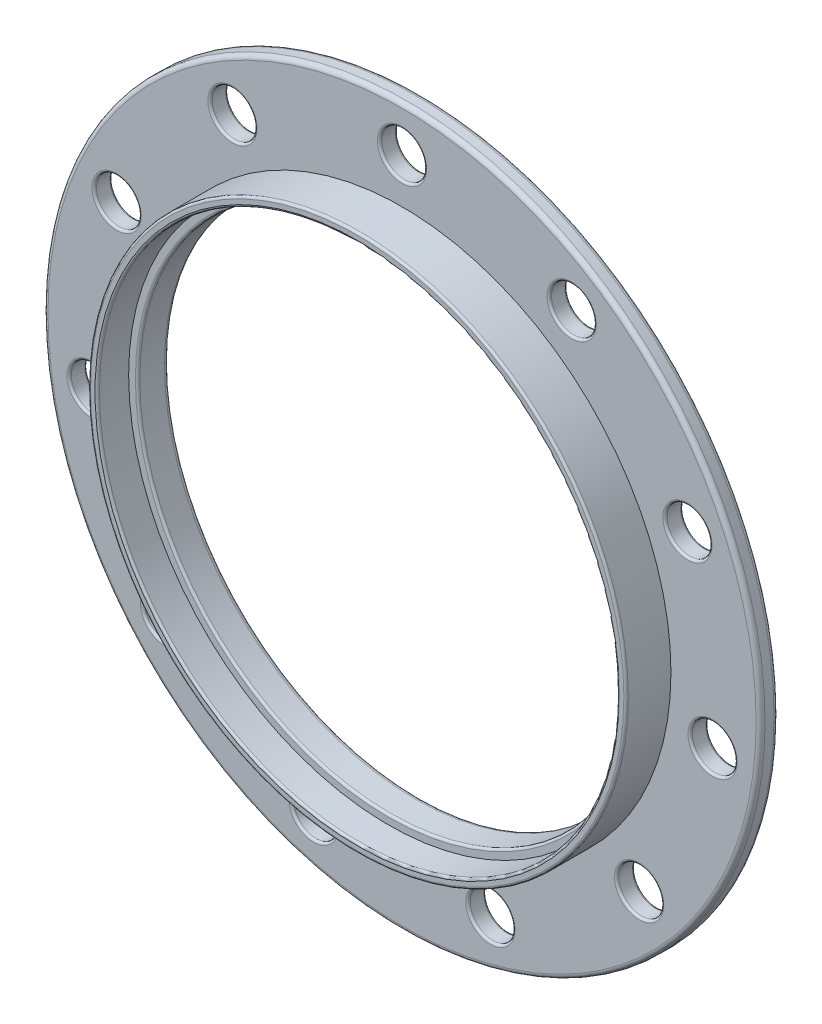
ISO-10303-21;
HEADER;
FILE_DESCRIPTION(('STEP AP214'),'2;1');
FILE_NAME('part.step','',(''),(''),'','','');
FILE_SCHEMA(('AUTOMOTIVE_DESIGN { 1 0 10303 214 1 1 1 1 }'));
ENDSEC;
DATA;
#1=APPLICATION_CONTEXT('core data for automotive mechanical design processes');
#2=APPLICATION_PROTOCOL_DEFINITION('international standard','automotive_design',2000,#1);
#3=PRODUCT_CONTEXT('',#1,'mechanical');
#4=PRODUCT('Part','Part','',(#3));
#5=PRODUCT_RELATED_PRODUCT_CATEGORY('part','',(#4));
#6=PRODUCT_DEFINITION_FORMATION('','',#4);
#7=PRODUCT_DEFINITION_CONTEXT('part definition',#1,'design');
#8=PRODUCT_DEFINITION('design','',#6,#7);
#9=PRODUCT_DEFINITION_SHAPE('','',#8);
#10=(LENGTH_UNIT() NAMED_UNIT(*) SI_UNIT(.MILLI.,.METRE.));
#11=(NAMED_UNIT(*) PLANE_ANGLE_UNIT() SI_UNIT($,.RADIAN.));
#12=(NAMED_UNIT(*) SI_UNIT($,.STERADIAN.) SOLID_ANGLE_UNIT());
#13=UNCERTAINTY_MEASURE_WITH_UNIT(LENGTH_MEASURE(1.E-05),#10,'distance_accuracy_value','');
#14=(GEOMETRIC_REPRESENTATION_CONTEXT(3) GLOBAL_UNCERTAINTY_ASSIGNED_CONTEXT((#13)) GLOBAL_UNIT_ASSIGNED_CONTEXT((#10,
#11,#12)) REPRESENTATION_CONTEXT('',''));
#15=CARTESIAN_POINT('',(0.,0.,0.));
#16=DIRECTION('',(0.,0.,1.));
#17=DIRECTION('',(1.,0.,0.));
#18=AXIS2_PLACEMENT_3D('',#15,#16,#17);
#19=CARTESIAN_POINT('',(0.,0.,7.));
#20=DIRECTION('',(0.,0.,-1.));
#21=DIRECTION('',(-1.,0.,0.));
#22=AXIS2_PLACEMENT_3D('',#19,#20,#21);
#23=CYLINDRICAL_SURFACE('',#22,29.);
#24=CARTESIAN_POINT('',(0.,0.,6.75));
#25=DIRECTION('',(0.,0.,1.));
#26=DIRECTION('',(1.,0.,0.));
#27=AXIS2_PLACEMENT_3D('',#24,#25,#26);
#28=CIRCLE('',#27,29.);
#29=CARTESIAN_POINT('',(29.,0.,6.75));
#30=VERTEX_POINT('',#29);
#31=EDGE_CURVE('E199',#30,#30,#28,.T.);
#32=ORIENTED_EDGE('',*,*,#31,.T.);
#33=EDGE_LOOP('',(#32));
#34=FACE_BOUND('',#33,.T.);
#35=CARTESIAN_POINT('',(0.,0.,3.5));
#36=DIRECTION('',(0.,0.,-1.));
#37=DIRECTION('',(-1.,0.,0.));
#38=AXIS2_PLACEMENT_3D('',#35,#36,#37);
#39=CIRCLE('',#38,29.);
#40=CARTESIAN_POINT('',(-29.,0.,3.5));
#41=VERTEX_POINT('',#40);
#42=EDGE_CURVE('E211',#41,#41,#39,.T.);
#43=ORIENTED_EDGE('',*,*,#42,.T.);
#44=EDGE_LOOP('',(#43));
#45=FACE_BOUND('',#44,.T.);
#46=ADVANCED_FACE('F32',(#34,#45),#23,.F.);
#47=CARTESIAN_POINT('',(0.,0.,2.));
#48=DIRECTION('',(0.,0.,-1.));
#49=DIRECTION('',(-1.,0.,0.));
#50=AXIS2_PLACEMENT_3D('',#47,#48,#49);
#51=CYLINDRICAL_SURFACE('',#50,40.);
#52=CARTESIAN_POINT('',(0.,0.,1.5));
#53=DIRECTION('',(0.,0.,1.));
#54=DIRECTION('',(1.,0.,0.));
#55=AXIS2_PLACEMENT_3D('',#52,#53,#54);
#56=CIRCLE('',#55,40.);
#57=CARTESIAN_POINT('',(40.,0.,1.5));
#58=VERTEX_POINT('',#57);
#59=EDGE_CURVE('E181',#58,#58,#56,.F.);
#60=ORIENTED_EDGE('',*,*,#59,.T.);
#61=EDGE_LOOP('',(#60));
#62=FACE_BOUND('',#61,.T.);
#63=CARTESIAN_POINT('',(0.,0.,0.5));
#64=DIRECTION('',(0.,0.,1.));
#65=DIRECTION('',(1.,0.,0.));
#66=AXIS2_PLACEMENT_3D('',#63,#64,#65);
#67=CIRCLE('',#66,40.);
#68=CARTESIAN_POINT('',(40.,0.,0.5));
#69=VERTEX_POINT('',#68);
#70=EDGE_CURVE('E184',#69,#69,#67,.T.);
#71=ORIENTED_EDGE('',*,*,#70,.T.);
#72=EDGE_LOOP('',(#71));
#73=FACE_BOUND('',#72,.T.);
#74=ADVANCED_FACE('F233',(#62,#73),#51,.T.);
#75=CARTESIAN_POINT('',(0.,0.,2.));
#76=DIRECTION('',(0.,0.,1.));
#77=DIRECTION('',(1.,0.,0.));
#78=AXIS2_PLACEMENT_3D('',#75,#76,#77);
#79=PLANE('',#78);
#80=CARTESIAN_POINT('',(26.451235102399,-22.920125688085,2.));
#81=DIRECTION('',(0.,0.,1.));
#82=DIRECTION('',(1.,0.,0.));
#83=AXIS2_PLACEMENT_3D('',#80,#81,#82);
#84=CIRCLE('',#83,2.75);
#85=CARTESIAN_POINT('',(29.201235102399,-22.920125688085,2.));
#86=VERTEX_POINT('',#85);
#87=EDGE_CURVE('E100',#86,#86,#84,.F.);
#88=ORIENTED_EDGE('',*,*,#87,.T.);
#89=EDGE_LOOP('',(#88));
#90=FACE_BOUND('',#89,.T.);
#91=CARTESIAN_POINT('',(34.6437504658327,-4.98101933956498,2.));
#92=DIRECTION('',(0.,0.,1.));
#93=DIRECTION('',(1.,0.,0.));
#94=AXIS2_PLACEMENT_3D('',#91,#92,#93);
#95=CIRCLE('',#94,2.75);
#96=CARTESIAN_POINT('',(37.3937504658327,-4.98101933956498,2.));
#97=VERTEX_POINT('',#96);
#98=EDGE_CURVE('E103',#97,#97,#95,.F.);
#99=ORIENTED_EDGE('',*,*,#98,.T.);
#100=EDGE_LOOP('',(#99));
#101=FACE_BOUND('',#100,.T.);
#102=CARTESIAN_POINT('',(31.8371198374081,14.539525455066,2.));
#103=DIRECTION('',(0.,0.,1.));
#104=DIRECTION('',(1.,0.,0.));
#105=AXIS2_PLACEMENT_3D('',#102,#103,#104);
#106=CIRCLE('',#105,2.75);
#107=CARTESIAN_POINT('',(34.5871198374081,14.539525455066,2.));
#108=VERTEX_POINT('',#107);
#109=EDGE_CURVE('E106',#108,#108,#106,.F.);
#110=ORIENTED_EDGE('',*,*,#109,.T.);
#111=EDGE_LOOP('',(#110));
#112=FACE_BOUND('',#111,.T.);
#113=CARTESIAN_POINT('',(18.9224286109459,29.4438736490913,2.));
#114=DIRECTION('',(0.,0.,1.));
#115=DIRECTION('',(1.,0.,0.));
#116=AXIS2_PLACEMENT_3D('',#113,#114,#115);
#117=CIRCLE('',#116,2.75);
#118=CARTESIAN_POINT('',(21.6724286109459,29.4438736490913,2.));
#119=VERTEX_POINT('',#118);
#120=EDGE_CURVE('E109',#119,#119,#117,.F.);
#121=ORIENTED_EDGE('',*,*,#120,.T.);
#122=EDGE_LOOP('',(#121));
#123=FACE_BOUND('',#122,.T.);
#124=CARTESIAN_POINT('',(0.,35.,2.));
#125=DIRECTION('',(0.,0.,1.));
#126=DIRECTION('',(1.,0.,0.));
#127=AXIS2_PLACEMENT_3D('',#124,#125,#126);
#128=CIRCLE('',#127,2.75);
#129=CARTESIAN_POINT('',(2.75,35.,2.));
#130=VERTEX_POINT('',#129);
#131=EDGE_CURVE('E112',#130,#130,#128,.F.);
#132=ORIENTED_EDGE('',*,*,#131,.T.);
#133=EDGE_LOOP('',(#132));
#134=FACE_BOUND('',#133,.T.);
#135=CARTESIAN_POINT('',(-18.9224286109459,29.4438736490913,2.));
#136=DIRECTION('',(0.,0.,1.));
#137=DIRECTION('',(1.,0.,0.));
#138=AXIS2_PLACEMENT_3D('',#135,#136,#137);
#139=CIRCLE('',#138,2.75);
#140=CARTESIAN_POINT('',(-16.1724286109459,29.4438736490913,2.));
#141=VERTEX_POINT('',#140);
#142=EDGE_CURVE('E115',#141,#141,#139,.F.);
#143=ORIENTED_EDGE('',*,*,#142,.T.);
#144=EDGE_LOOP('',(#143));
#145=FACE_BOUND('',#144,.T.);
#146=CARTESIAN_POINT('',(-31.8371198374082,14.539525455066,2.));
#147=DIRECTION('',(0.,0.,1.));
#148=DIRECTION('',(1.,0.,0.));
#149=AXIS2_PLACEMENT_3D('',#146,#147,#148);
#150=CIRCLE('',#149,2.75);
#151=CARTESIAN_POINT('',(-29.0871198374082,14.539525455066,2.));
#152=VERTEX_POINT('',#151);
#153=EDGE_CURVE('E118',#152,#152,#150,.F.);
#154=ORIENTED_EDGE('',*,*,#153,.T.);
#155=EDGE_LOOP('',(#154));
#156=FACE_BOUND('',#155,.T.);
#157=CARTESIAN_POINT('',(-34.6437504658326,-4.98101933956498,2.));
#158=DIRECTION('',(0.,0.,1.));
#159=DIRECTION('',(1.,0.,0.));
#160=AXIS2_PLACEMENT_3D('',#157,#158,#159);
#161=CIRCLE('',#160,2.75);
#162=CARTESIAN_POINT('',(-31.8937504658326,-4.98101933956498,2.));
#163=VERTEX_POINT('',#162);
#164=EDGE_CURVE('E121',#163,#163,#161,.F.);
#165=ORIENTED_EDGE('',*,*,#164,.T.);
#166=EDGE_LOOP('',(#165));
#167=FACE_BOUND('',#166,.T.);
#168=CARTESIAN_POINT('',(-26.451235102399,-22.920125688085,2.));
#169=DIRECTION('',(0.,0.,1.));
#170=DIRECTION('',(1.,0.,0.));
#171=AXIS2_PLACEMENT_3D('',#168,#169,#170);
#172=CIRCLE('',#171,2.75);
#173=CARTESIAN_POINT('',(-23.701235102399,-22.920125688085,2.));
#174=VERTEX_POINT('',#173);
#175=EDGE_CURVE('E124',#174,#174,#172,.F.);
#176=ORIENTED_EDGE('',*,*,#175,.T.);
#177=EDGE_LOOP('',(#176));
#178=FACE_BOUND('',#177,.T.);
#179=CARTESIAN_POINT('',(-9.86063948945005,-33.5822540765074,2.));
#180=DIRECTION('',(0.,0.,1.));
#181=DIRECTION('',(1.,0.,0.));
#182=AXIS2_PLACEMENT_3D('',#179,#180,#181);
#183=CIRCLE('',#182,2.75);
#184=CARTESIAN_POINT('',(-7.11063948945005,-33.5822540765074,2.));
#185=VERTEX_POINT('',#184);
#186=EDGE_CURVE('E127',#185,#185,#183,.F.);
#187=ORIENTED_EDGE('',*,*,#186,.T.);
#188=EDGE_LOOP('',(#187));
#189=FACE_BOUND('',#188,.T.);
#190=CARTESIAN_POINT('',(9.86063948945004,-33.5822540765074,2.));
#191=DIRECTION('',(0.,0.,1.));
#192=DIRECTION('',(1.,0.,0.));
#193=AXIS2_PLACEMENT_3D('',#190,#191,#192);
#194=CIRCLE('',#193,2.75);
#195=CARTESIAN_POINT('',(12.61063948945,-33.5822540765074,2.));
#196=VERTEX_POINT('',#195);
#197=EDGE_CURVE('E130',#196,#196,#194,.F.);
#198=ORIENTED_EDGE('',*,*,#197,.T.);
#199=EDGE_LOOP('',(#198));
#200=FACE_BOUND('',#199,.T.);
#201=CARTESIAN_POINT('',(0.,0.,2.));
#202=DIRECTION('',(0.,0.,1.));
#203=DIRECTION('',(1.,0.,0.));
#204=AXIS2_PLACEMENT_3D('',#201,#202,#203);
#205=CIRCLE('',#204,39.5);
#206=CARTESIAN_POINT('',(39.5,0.,2.));
#207=VERTEX_POINT('',#206);
#208=EDGE_CURVE('E187',#207,#207,#205,.T.);
#209=ORIENTED_EDGE('',*,*,#208,.T.);
#210=EDGE_LOOP('',(#209));
#211=FACE_BOUND('',#210,.T.);
#212=CARTESIAN_POINT('',(0.,0.,2.));
#213=DIRECTION('',(0.,0.,1.));
#214=DIRECTION('',(1.,0.,0.));
#215=AXIS2_PLACEMENT_3D('',#212,#213,#214);
#216=CIRCLE('',#215,30.);
#217=CARTESIAN_POINT('',(30.,0.,2.));
#218=VERTEX_POINT('',#217);
#219=EDGE_CURVE('E208',#218,#218,#216,.T.);
#220=ORIENTED_EDGE('',*,*,#219,.F.);
#221=EDGE_LOOP('',(#220));
#222=FACE_BOUND('',#221,.T.);
#223=ADVANCED_FACE('F239',(#90,#101,#112,#123,#134,#145,#156,#167,#178,#189,#200,#211,#222),#79,.T.);
#224=CARTESIAN_POINT('',(0.,0.,0.));
#225=DIRECTION('',(0.,0.,1.));
#226=DIRECTION('',(1.,0.,0.));
#227=AXIS2_PLACEMENT_3D('',#224,#225,#226);
#228=PLANE('',#227);
#229=CARTESIAN_POINT('',(26.451235102399,-22.920125688085,0.));
#230=DIRECTION('',(0.,0.,1.));
#231=DIRECTION('',(1.,0.,0.));
#232=AXIS2_PLACEMENT_3D('',#229,#230,#231);
#233=CIRCLE('',#232,2.75);
#234=CARTESIAN_POINT('',(29.201235102399,-22.920125688085,0.));
#235=VERTEX_POINT('',#234);
#236=EDGE_CURVE('E139',#235,#235,#233,.T.);
#237=ORIENTED_EDGE('',*,*,#236,.T.);
#238=EDGE_LOOP('',(#237));
#239=FACE_BOUND('',#238,.T.);
#240=CARTESIAN_POINT('',(34.6437504658327,-4.98101933956498,0.));
#241=DIRECTION('',(0.,0.,1.));
#242=DIRECTION('',(1.,0.,0.));
#243=AXIS2_PLACEMENT_3D('',#240,#241,#242);
#244=CIRCLE('',#243,2.75);
#245=CARTESIAN_POINT('',(37.3937504658327,-4.98101933956498,0.));
#246=VERTEX_POINT('',#245);
#247=EDGE_CURVE('E142',#246,#246,#244,.T.);
#248=ORIENTED_EDGE('',*,*,#247,.T.);
#249=EDGE_LOOP('',(#248));
#250=FACE_BOUND('',#249,.T.);
#251=CARTESIAN_POINT('',(31.8371198374081,14.539525455066,0.));
#252=DIRECTION('',(0.,0.,1.));
#253=DIRECTION('',(1.,0.,0.));
#254=AXIS2_PLACEMENT_3D('',#251,#252,#253);
#255=CIRCLE('',#254,2.75);
#256=CARTESIAN_POINT('',(34.5871198374081,14.539525455066,0.));
#257=VERTEX_POINT('',#256);
#258=EDGE_CURVE('E145',#257,#257,#255,.T.);
#259=ORIENTED_EDGE('',*,*,#258,.T.);
#260=EDGE_LOOP('',(#259));
#261=FACE_BOUND('',#260,.T.);
#262=CARTESIAN_POINT('',(18.9224286109459,29.4438736490913,0.));
#263=DIRECTION('',(0.,0.,1.));
#264=DIRECTION('',(1.,0.,0.));
#265=AXIS2_PLACEMENT_3D('',#262,#263,#264);
#266=CIRCLE('',#265,2.75);
#267=CARTESIAN_POINT('',(21.6724286109459,29.4438736490913,0.));
#268=VERTEX_POINT('',#267);
#269=EDGE_CURVE('E148',#268,#268,#266,.T.);
#270=ORIENTED_EDGE('',*,*,#269,.T.);
#271=EDGE_LOOP('',(#270));
#272=FACE_BOUND('',#271,.T.);
#273=CARTESIAN_POINT('',(0.,35.,0.));
#274=DIRECTION('',(0.,0.,1.));
#275=DIRECTION('',(1.,0.,0.));
#276=AXIS2_PLACEMENT_3D('',#273,#274,#275);
#277=CIRCLE('',#276,2.75);
#278=CARTESIAN_POINT('',(2.75,35.,0.));
#279=VERTEX_POINT('',#278);
#280=EDGE_CURVE('E151',#279,#279,#277,.T.);
#281=ORIENTED_EDGE('',*,*,#280,.T.);
#282=EDGE_LOOP('',(#281));
#283=FACE_BOUND('',#282,.T.);
#284=CARTESIAN_POINT('',(-18.9224286109459,29.4438736490913,0.));
#285=DIRECTION('',(0.,0.,1.));
#286=DIRECTION('',(1.,0.,0.));
#287=AXIS2_PLACEMENT_3D('',#284,#285,#286);
#288=CIRCLE('',#287,2.75);
#289=CARTESIAN_POINT('',(-16.1724286109459,29.4438736490913,0.));
#290=VERTEX_POINT('',#289);
#291=EDGE_CURVE('E154',#290,#290,#288,.T.);
#292=ORIENTED_EDGE('',*,*,#291,.T.);
#293=EDGE_LOOP('',(#292));
#294=FACE_BOUND('',#293,.T.);
#295=CARTESIAN_POINT('',(-31.8371198374082,14.539525455066,0.));
#296=DIRECTION('',(0.,0.,1.));
#297=DIRECTION('',(1.,0.,0.));
#298=AXIS2_PLACEMENT_3D('',#295,#296,#297);
#299=CIRCLE('',#298,2.75);
#300=CARTESIAN_POINT('',(-29.0871198374082,14.539525455066,0.));
#301=VERTEX_POINT('',#300);
#302=EDGE_CURVE('E157',#301,#301,#299,.T.);
#303=ORIENTED_EDGE('',*,*,#302,.T.);
#304=EDGE_LOOP('',(#303));
#305=FACE_BOUND('',#304,.T.);
#306=CARTESIAN_POINT('',(-34.6437504658326,-4.98101933956498,0.));
#307=DIRECTION('',(0.,0.,1.));
#308=DIRECTION('',(1.,0.,0.));
#309=AXIS2_PLACEMENT_3D('',#306,#307,#308);
#310=CIRCLE('',#309,2.75);
#311=CARTESIAN_POINT('',(-31.8937504658326,-4.98101933956498,0.));
#312=VERTEX_POINT('',#311);
#313=EDGE_CURVE('E160',#312,#312,#310,.T.);
#314=ORIENTED_EDGE('',*,*,#313,.T.);
#315=EDGE_LOOP('',(#314));
#316=FACE_BOUND('',#315,.T.);
#317=CARTESIAN_POINT('',(-26.451235102399,-22.920125688085,0.));
#318=DIRECTION('',(0.,0.,1.));
#319=DIRECTION('',(1.,0.,0.));
#320=AXIS2_PLACEMENT_3D('',#317,#318,#319);
#321=CIRCLE('',#320,2.75);
#322=CARTESIAN_POINT('',(-23.701235102399,-22.920125688085,0.));
#323=VERTEX_POINT('',#322);
#324=EDGE_CURVE('E163',#323,#323,#321,.T.);
#325=ORIENTED_EDGE('',*,*,#324,.T.);
#326=EDGE_LOOP('',(#325));
#327=FACE_BOUND('',#326,.T.);
#328=CARTESIAN_POINT('',(-9.86063948945005,-33.5822540765074,0.));
#329=DIRECTION('',(0.,0.,1.));
#330=DIRECTION('',(1.,0.,0.));
#331=AXIS2_PLACEMENT_3D('',#328,#329,#330);
#332=CIRCLE('',#331,2.75);
#333=CARTESIAN_POINT('',(-7.11063948945005,-33.5822540765074,0.));
#334=VERTEX_POINT('',#333);
#335=EDGE_CURVE('E166',#334,#334,#332,.T.);
#336=ORIENTED_EDGE('',*,*,#335,.T.);
#337=EDGE_LOOP('',(#336));
#338=FACE_BOUND('',#337,.T.);
#339=CARTESIAN_POINT('',(9.86063948945004,-33.5822540765074,0.));
#340=DIRECTION('',(0.,0.,1.));
#341=DIRECTION('',(1.,0.,0.));
#342=AXIS2_PLACEMENT_3D('',#339,#340,#341);
#343=CIRCLE('',#342,2.75);
#344=CARTESIAN_POINT('',(12.61063948945,-33.5822540765074,0.));
#345=VERTEX_POINT('',#344);
#346=EDGE_CURVE('E169',#345,#345,#343,.T.);
#347=ORIENTED_EDGE('',*,*,#346,.T.);
#348=EDGE_LOOP('',(#347));
#349=FACE_BOUND('',#348,.T.);
#350=CARTESIAN_POINT('',(0.,0.,0.));
#351=DIRECTION('',(0.,0.,1.));
#352=DIRECTION('',(1.,0.,0.));
#353=AXIS2_PLACEMENT_3D('',#350,#351,#352);
#354=CIRCLE('',#353,28.5);
#355=CARTESIAN_POINT('',(28.5,0.,0.));
#356=VERTEX_POINT('',#355);
#357=EDGE_CURVE('E172',#356,#356,#354,.T.);
#358=ORIENTED_EDGE('',*,*,#357,.T.);
#359=EDGE_LOOP('',(#358));
#360=FACE_BOUND('',#359,.T.);
#361=CARTESIAN_POINT('',(0.,0.,0.));
#362=DIRECTION('',(0.,0.,1.));
#363=DIRECTION('',(1.,0.,0.));
#364=AXIS2_PLACEMENT_3D('',#361,#362,#363);
#365=CIRCLE('',#364,39.5);
#366=CARTESIAN_POINT('',(39.5,0.,0.));
#367=VERTEX_POINT('',#366);
#368=EDGE_CURVE('E175',#367,#367,#365,.F.);
#369=ORIENTED_EDGE('',*,*,#368,.T.);
#370=EDGE_LOOP('',(#369));
#371=FACE_BOUND('',#370,.T.);
#372=ADVANCED_FACE('F250',(#239,#250,#261,#272,#283,#294,#305,#316,#327,#338,#349,#360,#371),
#228,.F.);
#373=CARTESIAN_POINT('',(0.,0.,7.));
#374=DIRECTION('',(0.,0.,1.));
#375=DIRECTION('',(1.,0.,0.));
#376=AXIS2_PLACEMENT_3D('',#373,#374,#375);
#377=PLANE('',#376);
#378=CARTESIAN_POINT('',(0.,0.,7.));
#379=DIRECTION('',(0.,0.,1.));
#380=DIRECTION('',(1.,0.,0.));
#381=AXIS2_PLACEMENT_3D('',#378,#379,#380);
#382=CIRCLE('',#381,29.25);
#383=CARTESIAN_POINT('',(29.25,0.,7.));
#384=VERTEX_POINT('',#383);
#385=EDGE_CURVE('E193',#384,#384,#382,.F.);
#386=ORIENTED_EDGE('',*,*,#385,.T.);
#387=EDGE_LOOP('',(#386));
#388=FACE_BOUND('',#387,.T.);
#389=CARTESIAN_POINT('',(0.,0.,7.));
#390=DIRECTION('',(0.,0.,1.));
#391=DIRECTION('',(1.,0.,0.));
#392=AXIS2_PLACEMENT_3D('',#389,#390,#391);
#393=CIRCLE('',#392,29.75);
#394=CARTESIAN_POINT('',(29.75,0.,7.));
#395=VERTEX_POINT('',#394);
#396=EDGE_CURVE('E196',#395,#395,#393,.T.);
#397=ORIENTED_EDGE('',*,*,#396,.T.);
#398=EDGE_LOOP('',(#397));
#399=FACE_BOUND('',#398,.T.);
#400=ADVANCED_FACE('F246',(#388,#399),#377,.T.);
#401=CARTESIAN_POINT('',(0.,0.,7.));
#402=DIRECTION('',(0.,0.,-1.));
#403=DIRECTION('',(-1.,0.,0.));
#404=AXIS2_PLACEMENT_3D('',#401,#402,#403);
#405=CYLINDRICAL_SURFACE('',#404,30.);
#406=CARTESIAN_POINT('',(0.,0.,6.75));
#407=DIRECTION('',(0.,0.,1.));
#408=DIRECTION('',(1.,0.,0.));
#409=AXIS2_PLACEMENT_3D('',#406,#407,#408);
#410=CIRCLE('',#409,30.);
#411=CARTESIAN_POINT('',(30.,0.,6.75));
#412=VERTEX_POINT('',#411);
#413=EDGE_CURVE('E190',#412,#412,#410,.F.);
#414=ORIENTED_EDGE('',*,*,#413,.T.);
#415=EDGE_LOOP('',(#414));
#416=FACE_BOUND('',#415,.T.);
#417=ORIENTED_EDGE('',*,*,#219,.T.);
#418=EDGE_LOOP('',(#417));
#419=FACE_BOUND('',#418,.T.);
#420=ADVANCED_FACE('F249',(#416,#419),#405,.T.);
#421=CARTESIAN_POINT('',(18.9224286109459,29.4438736490913,0.));
#422=DIRECTION('',(0.,0.,1.));
#423=DIRECTION('',(1.,0.,0.));
#424=AXIS2_PLACEMENT_3D('',#421,#422,#423);
#425=CYLINDRICAL_SURFACE('',#424,2.5);
#426=CARTESIAN_POINT('',(18.9224286109459,29.4438736490913,0.25));
#427=DIRECTION('',(0.,0.,1.));
#428=DIRECTION('',(1.,0.,0.));
#429=AXIS2_PLACEMENT_3D('',#426,#427,#428);
#430=CIRCLE('',#429,2.5);
#431=CARTESIAN_POINT('',(21.4224286109459,29.4438736490913,0.25));
#432=VERTEX_POINT('',#431);
#433=EDGE_CURVE('E82',#432,#432,#430,.F.);
#434=ORIENTED_EDGE('',*,*,#433,.T.);
#435=EDGE_LOOP('',(#434));
#436=FACE_BOUND('',#435,.T.);
#437=CARTESIAN_POINT('',(18.9224286109459,29.4438736490913,1.75));
#438=DIRECTION('',(0.,0.,1.));
#439=DIRECTION('',(1.,0.,0.));
#440=AXIS2_PLACEMENT_3D('',#437,#438,#439);
#441=CIRCLE('',#440,2.5);
#442=CARTESIAN_POINT('',(21.4224286109459,29.4438736490913,1.75));
#443=VERTEX_POINT('',#442);
#444=EDGE_CURVE('E85',#443,#443,#441,.T.);
#445=ORIENTED_EDGE('',*,*,#444,.T.);
#446=EDGE_LOOP('',(#445));
#447=FACE_BOUND('',#446,.T.);
#448=ADVANCED_FACE('F254',(#436,#447),#425,.F.);
#449=CARTESIAN_POINT('',(31.8371198374081,14.539525455066,0.));
#450=DIRECTION('',(0.,0.,1.));
#451=DIRECTION('',(1.,0.,0.));
#452=AXIS2_PLACEMENT_3D('',#449,#450,#451);
#453=CYLINDRICAL_SURFACE('',#452,2.5);
#454=CARTESIAN_POINT('',(31.8371198374081,14.539525455066,0.25));
#455=DIRECTION('',(0.,0.,1.));
#456=DIRECTION('',(1.,0.,0.));
#457=AXIS2_PLACEMENT_3D('',#454,#455,#456);
#458=CIRCLE('',#457,2.5);
#459=CARTESIAN_POINT('',(34.3371198374081,14.539525455066,0.25));
#460=VERTEX_POINT('',#459);
#461=EDGE_CURVE('E88',#460,#460,#458,.F.);
#462=ORIENTED_EDGE('',*,*,#461,.T.);
#463=EDGE_LOOP('',(#462));
#464=FACE_BOUND('',#463,.T.);
#465=CARTESIAN_POINT('',(31.8371198374081,14.539525455066,1.75));
#466=DIRECTION('',(0.,0.,1.));
#467=DIRECTION('',(1.,0.,0.));
#468=AXIS2_PLACEMENT_3D('',#465,#466,#467);
#469=CIRCLE('',#468,2.5);
#470=CARTESIAN_POINT('',(34.3371198374081,14.539525455066,1.75));
#471=VERTEX_POINT('',#470);
#472=EDGE_CURVE('E91',#471,#471,#469,.T.);
#473=ORIENTED_EDGE('',*,*,#472,.T.);
#474=EDGE_LOOP('',(#473));
#475=FACE_BOUND('',#474,.T.);
#476=ADVANCED_FACE('F605',(#464,#475),#453,.F.);
#477=CARTESIAN_POINT('',(34.6437504658327,-4.98101933956498,0.));
#478=DIRECTION('',(0.,0.,1.));
#479=DIRECTION('',(1.,0.,0.));
#480=AXIS2_PLACEMENT_3D('',#477,#478,#479);
#481=CYLINDRICAL_SURFACE('',#480,2.5);
#482=CARTESIAN_POINT('',(34.6437504658327,-4.98101933956498,0.25));
#483=DIRECTION('',(0.,0.,1.));
#484=DIRECTION('',(1.,0.,0.));
#485=AXIS2_PLACEMENT_3D('',#482,#483,#484);
#486=CIRCLE('',#485,2.5);
#487=CARTESIAN_POINT('',(37.1437504658327,-4.98101933956498,0.25));
#488=VERTEX_POINT('',#487);
#489=EDGE_CURVE('E94',#488,#488,#486,.F.);
#490=ORIENTED_EDGE('',*,*,#489,.T.);
#491=EDGE_LOOP('',(#490));
#492=FACE_BOUND('',#491,.T.);
#493=CARTESIAN_POINT('',(34.6437504658327,-4.98101933956498,1.75));
#494=DIRECTION('',(0.,0.,1.));
#495=DIRECTION('',(1.,0.,0.));
#496=AXIS2_PLACEMENT_3D('',#493,#494,#495);
#497=CIRCLE('',#496,2.5);
#498=CARTESIAN_POINT('',(37.1437504658327,-4.98101933956498,1.75));
#499=VERTEX_POINT('',#498);
#500=EDGE_CURVE('E97',#499,#499,#497,.T.);
#501=ORIENTED_EDGE('',*,*,#500,.T.);
#502=EDGE_LOOP('',(#501));
#503=FACE_BOUND('',#502,.T.);
#504=ADVANCED_FACE('F595',(#492,#503),#481,.F.);
#505=CARTESIAN_POINT('',(26.451235102399,-22.920125688085,0.));
#506=DIRECTION('',(0.,0.,1.));
#507=DIRECTION('',(1.,0.,0.));
#508=AXIS2_PLACEMENT_3D('',#505,#506,#507);
#509=CYLINDRICAL_SURFACE('',#508,2.5);
#510=CARTESIAN_POINT('',(26.451235102399,-22.920125688085,0.25));
#511=DIRECTION('',(0.,0.,1.));
#512=DIRECTION('',(1.,0.,0.));
#513=AXIS2_PLACEMENT_3D('',#510,#511,#512);
#514=CIRCLE('',#513,2.5);
#515=CARTESIAN_POINT('',(28.951235102399,-22.920125688085,0.25));
#516=VERTEX_POINT('',#515);
#517=EDGE_CURVE('E133',#516,#516,#514,.F.);
#518=ORIENTED_EDGE('',*,*,#517,.T.);
#519=EDGE_LOOP('',(#518));
#520=FACE_BOUND('',#519,.T.);
#521=CARTESIAN_POINT('',(26.451235102399,-22.920125688085,1.75));
#522=DIRECTION('',(0.,0.,1.));
#523=DIRECTION('',(1.,0.,0.));
#524=AXIS2_PLACEMENT_3D('',#521,#522,#523);
#525=CIRCLE('',#524,2.5);
#526=CARTESIAN_POINT('',(28.951235102399,-22.920125688085,1.75));
#527=VERTEX_POINT('',#526);
#528=EDGE_CURVE('E136',#527,#527,#525,.T.);
#529=ORIENTED_EDGE('',*,*,#528,.T.);
#530=EDGE_LOOP('',(#529));
#531=FACE_BOUND('',#530,.T.);
#532=ADVANCED_FACE('F586',(#520,#531),#509,.F.);
#533=CARTESIAN_POINT('',(9.86063948945004,-33.5822540765074,0.));
#534=DIRECTION('',(0.,0.,1.));
#535=DIRECTION('',(1.,0.,0.));
#536=AXIS2_PLACEMENT_3D('',#533,#534,#535);
#537=CYLINDRICAL_SURFACE('',#536,2.5);
#538=CARTESIAN_POINT('',(9.86063948945004,-33.5822540765074,1.75));
#539=DIRECTION('',(0.,0.,1.));
#540=DIRECTION('',(1.,0.,0.));
#541=AXIS2_PLACEMENT_3D('',#538,#539,#540);
#542=CIRCLE('',#541,2.5);
#543=CARTESIAN_POINT('',(12.36063948945,-33.5822540765074,1.75));
#544=VERTEX_POINT('',#543);
#545=EDGE_CURVE('E10',#544,#544,#542,.T.);
#546=ORIENTED_EDGE('',*,*,#545,.T.);
#547=EDGE_LOOP('',(#546));
#548=FACE_BOUND('',#547,.T.);
#549=CARTESIAN_POINT('',(9.86063948945004,-33.5822540765074,0.25));
#550=DIRECTION('',(0.,0.,1.));
#551=DIRECTION('',(1.,0.,0.));
#552=AXIS2_PLACEMENT_3D('',#549,#550,#551);
#553=CIRCLE('',#552,2.5);
#554=CARTESIAN_POINT('',(12.36063948945,-33.5822540765074,0.25));
#555=VERTEX_POINT('',#554);
#556=EDGE_CURVE('E39',#555,#555,#553,.F.);
#557=ORIENTED_EDGE('',*,*,#556,.T.);
#558=EDGE_LOOP('',(#557));
#559=FACE_BOUND('',#558,.T.);
#560=ADVANCED_FACE('F576',(#548,#559),#537,.F.);
#561=CARTESIAN_POINT('',(-9.86063948945005,-33.5822540765074,0.));
#562=DIRECTION('',(0.,0.,1.));
#563=DIRECTION('',(1.,0.,0.));
#564=AXIS2_PLACEMENT_3D('',#561,#562,#563);
#565=CYLINDRICAL_SURFACE('',#564,2.5);
#566=CARTESIAN_POINT('',(-9.86063948945005,-33.5822540765074,1.75));
#567=DIRECTION('',(0.,0.,1.));
#568=DIRECTION('',(1.,0.,0.));
#569=AXIS2_PLACEMENT_3D('',#566,#567,#568);
#570=CIRCLE('',#569,2.5);
#571=CARTESIAN_POINT('',(-7.36063948945005,-33.5822540765074,1.75));
#572=VERTEX_POINT('',#571);
#573=EDGE_CURVE('E43',#572,#572,#570,.T.);
#574=ORIENTED_EDGE('',*,*,#573,.T.);
#575=EDGE_LOOP('',(#574));
#576=FACE_BOUND('',#575,.T.);
#577=CARTESIAN_POINT('',(-9.86063948945005,-33.5822540765074,0.25));
#578=DIRECTION('',(0.,0.,1.));
#579=DIRECTION('',(1.,0.,0.));
#580=AXIS2_PLACEMENT_3D('',#577,#578,#579);
#581=CIRCLE('',#580,2.5);
#582=CARTESIAN_POINT('',(-7.36063948945005,-33.5822540765074,0.25));
#583=VERTEX_POINT('',#582);
#584=EDGE_CURVE('E47',#583,#583,#581,.F.);
#585=ORIENTED_EDGE('',*,*,#584,.T.);
#586=EDGE_LOOP('',(#585));
#587=FACE_BOUND('',#586,.T.);
#588=ADVANCED_FACE('F567',(#576,#587),#565,.F.);
#589=CARTESIAN_POINT('',(-26.451235102399,-22.920125688085,0.));
#590=DIRECTION('',(0.,0.,1.));
#591=DIRECTION('',(1.,0.,0.));
#592=AXIS2_PLACEMENT_3D('',#589,#590,#591);
#593=CYLINDRICAL_SURFACE('',#592,2.5);
#594=CARTESIAN_POINT('',(-26.451235102399,-22.920125688085,1.75));
#595=DIRECTION('',(0.,0.,1.));
#596=DIRECTION('',(1.,0.,0.));
#597=AXIS2_PLACEMENT_3D('',#594,#595,#596);
#598=CIRCLE('',#597,2.5);
#599=CARTESIAN_POINT('',(-23.951235102399,-22.920125688085,1.75));
#600=VERTEX_POINT('',#599);
#601=EDGE_CURVE('E52',#600,#600,#598,.T.);
#602=ORIENTED_EDGE('',*,*,#601,.T.);
#603=EDGE_LOOP('',(#602));
#604=FACE_BOUND('',#603,.T.);
#605=CARTESIAN_POINT('',(-26.451235102399,-22.920125688085,0.25));
#606=DIRECTION('',(0.,0.,1.));
#607=DIRECTION('',(1.,0.,0.));
#608=AXIS2_PLACEMENT_3D('',#605,#606,#607);
#609=CIRCLE('',#608,2.5);
#610=CARTESIAN_POINT('',(-23.951235102399,-22.920125688085,0.25));
#611=VERTEX_POINT('',#610);
#612=EDGE_CURVE('E55',#611,#611,#609,.F.);
#613=ORIENTED_EDGE('',*,*,#612,.T.);
#614=EDGE_LOOP('',(#613));
#615=FACE_BOUND('',#614,.T.);
#616=ADVANCED_FACE('F558',(#604,#615),#593,.F.);
#617=CARTESIAN_POINT('',(-34.6437504658326,-4.98101933956498,0.));
#618=DIRECTION('',(0.,0.,1.));
#619=DIRECTION('',(1.,0.,0.));
#620=AXIS2_PLACEMENT_3D('',#617,#618,#619);
#621=CYLINDRICAL_SURFACE('',#620,2.5);
#622=CARTESIAN_POINT('',(-34.6437504658326,-4.98101933956498,1.75));
#623=DIRECTION('',(0.,0.,1.));
#624=DIRECTION('',(1.,0.,0.));
#625=AXIS2_PLACEMENT_3D('',#622,#623,#624);
#626=CIRCLE('',#625,2.5);
#627=CARTESIAN_POINT('',(-32.1437504658326,-4.98101933956498,1.75));
#628=VERTEX_POINT('',#627);
#629=EDGE_CURVE('E58',#628,#628,#626,.T.);
#630=ORIENTED_EDGE('',*,*,#629,.T.);
#631=EDGE_LOOP('',(#630));
#632=FACE_BOUND('',#631,.T.);
#633=CARTESIAN_POINT('',(-34.6437504658326,-4.98101933956498,0.25));
#634=DIRECTION('',(0.,0.,1.));
#635=DIRECTION('',(1.,0.,0.));
#636=AXIS2_PLACEMENT_3D('',#633,#634,#635);
#637=CIRCLE('',#636,2.5);
#638=CARTESIAN_POINT('',(-32.1437504658326,-4.98101933956498,0.25));
#639=VERTEX_POINT('',#638);
#640=EDGE_CURVE('E61',#639,#639,#637,.F.);
#641=ORIENTED_EDGE('',*,*,#640,.T.);
#642=EDGE_LOOP('',(#641));
#643=FACE_BOUND('',#642,.T.);
#644=ADVANCED_FACE('F244',(#632,#643),#621,.F.);
#645=CARTESIAN_POINT('',(-31.8371198374082,14.539525455066,0.));
#646=DIRECTION('',(0.,0.,1.));
#647=DIRECTION('',(1.,0.,0.));
#648=AXIS2_PLACEMENT_3D('',#645,#646,#647);
#649=CYLINDRICAL_SURFACE('',#648,2.5);
#650=CARTESIAN_POINT('',(-31.8371198374082,14.539525455066,1.75));
#651=DIRECTION('',(0.,0.,1.));
#652=DIRECTION('',(1.,0.,0.));
#653=AXIS2_PLACEMENT_3D('',#650,#651,#652);
#654=CIRCLE('',#653,2.5);
#655=CARTESIAN_POINT('',(-29.3371198374082,14.539525455066,1.75));
#656=VERTEX_POINT('',#655);
#657=EDGE_CURVE('E64',#656,#656,#654,.T.);
#658=ORIENTED_EDGE('',*,*,#657,.T.);
#659=EDGE_LOOP('',(#658));
#660=FACE_BOUND('',#659,.T.);
#661=CARTESIAN_POINT('',(-31.8371198374082,14.539525455066,0.25));
#662=DIRECTION('',(0.,0.,1.));
#663=DIRECTION('',(1.,0.,0.));
#664=AXIS2_PLACEMENT_3D('',#661,#662,#663);
#665=CIRCLE('',#664,2.5);
#666=CARTESIAN_POINT('',(-29.3371198374082,14.539525455066,0.25));
#667=VERTEX_POINT('',#666);
#668=EDGE_CURVE('E67',#667,#667,#665,.F.);
#669=ORIENTED_EDGE('',*,*,#668,.T.);
#670=EDGE_LOOP('',(#669));
#671=FACE_BOUND('',#670,.T.);
#672=ADVANCED_FACE('F539',(#660,#671),#649,.F.);
#673=CARTESIAN_POINT('',(-18.9224286109459,29.4438736490913,0.));
#674=DIRECTION('',(0.,0.,1.));
#675=DIRECTION('',(1.,0.,0.));
#676=AXIS2_PLACEMENT_3D('',#673,#674,#675);
#677=CYLINDRICAL_SURFACE('',#676,2.5);
#678=CARTESIAN_POINT('',(-18.9224286109459,29.4438736490913,1.75));
#679=DIRECTION('',(0.,0.,1.));
#680=DIRECTION('',(1.,0.,0.));
#681=AXIS2_PLACEMENT_3D('',#678,#679,#680);
#682=CIRCLE('',#681,2.5);
#683=CARTESIAN_POINT('',(-16.4224286109459,29.4438736490913,1.75));
#684=VERTEX_POINT('',#683);
#685=EDGE_CURVE('E70',#684,#684,#682,.T.);
#686=ORIENTED_EDGE('',*,*,#685,.T.);
#687=EDGE_LOOP('',(#686));
#688=FACE_BOUND('',#687,.T.);
#689=CARTESIAN_POINT('',(-18.9224286109459,29.4438736490913,0.25));
#690=DIRECTION('',(0.,0.,1.));
#691=DIRECTION('',(1.,0.,0.));
#692=AXIS2_PLACEMENT_3D('',#689,#690,#691);
#693=CIRCLE('',#692,2.5);
#694=CARTESIAN_POINT('',(-16.4224286109459,29.4438736490913,0.25));
#695=VERTEX_POINT('',#694);
#696=EDGE_CURVE('E73',#695,#695,#693,.F.);
#697=ORIENTED_EDGE('',*,*,#696,.T.);
#698=EDGE_LOOP('',(#697));
#699=FACE_BOUND('',#698,.T.);
#700=ADVANCED_FACE('F229',(#688,#699),#677,.F.);
#701=CARTESIAN_POINT('',(0.,35.,0.));
#702=DIRECTION('',(0.,0.,1.));
#703=DIRECTION('',(1.,0.,0.));
#704=AXIS2_PLACEMENT_3D('',#701,#702,#703);
#705=CYLINDRICAL_SURFACE('',#704,2.5);
#706=CARTESIAN_POINT('',(0.,35.,0.25));
#707=DIRECTION('',(0.,0.,1.));
#708=DIRECTION('',(1.,0.,0.));
#709=AXIS2_PLACEMENT_3D('',#706,#707,#708);
#710=CIRCLE('',#709,2.5);
#711=CARTESIAN_POINT('',(2.5,35.,0.25));
#712=VERTEX_POINT('',#711);
#713=EDGE_CURVE('E76',#712,#712,#710,.F.);
#714=ORIENTED_EDGE('',*,*,#713,.T.);
#715=EDGE_LOOP('',(#714));
#716=FACE_BOUND('',#715,.T.);
#717=CARTESIAN_POINT('',(0.,35.,1.75));
#718=DIRECTION('',(0.,0.,1.));
#719=DIRECTION('',(1.,0.,0.));
#720=AXIS2_PLACEMENT_3D('',#717,#718,#719);
#721=CIRCLE('',#720,2.5);
#722=CARTESIAN_POINT('',(2.5,35.,1.75));
#723=VERTEX_POINT('',#722);
#724=EDGE_CURVE('E79',#723,#723,#721,.T.);
#725=ORIENTED_EDGE('',*,*,#724,.T.);
#726=EDGE_LOOP('',(#725));
#727=FACE_BOUND('',#726,.T.);
#728=ADVANCED_FACE('F219',(#716,#727),#705,.F.);
#729=CARTESIAN_POINT('',(0.,0.,3.5));
#730=DIRECTION('',(0.,0.,-1.));
#731=DIRECTION('',(-1.,0.,0.));
#732=AXIS2_PLACEMENT_3D('',#729,#730,#731);
#733=PLANE('',#732);
#734=CARTESIAN_POINT('',(0.,0.,3.5));
#735=DIRECTION('',(0.,0.,-1.));
#736=DIRECTION('',(-1.,0.,0.));
#737=AXIS2_PLACEMENT_3D('',#734,#735,#736);
#738=CIRCLE('',#737,28.25);
#739=CARTESIAN_POINT('',(-28.25,0.,3.5));
#740=VERTEX_POINT('',#739);
#741=EDGE_CURVE('E205',#740,#740,#738,.T.);
#742=ORIENTED_EDGE('',*,*,#741,.T.);
#743=EDGE_LOOP('',(#742));
#744=FACE_BOUND('',#743,.T.);
#745=ORIENTED_EDGE('',*,*,#42,.F.);
#746=EDGE_LOOP('',(#745));
#747=FACE_BOUND('',#746,.T.);
#748=ADVANCED_FACE('F216',(#744,#747),#733,.F.);
#749=CARTESIAN_POINT('',(0.,0.,3.5));
#750=DIRECTION('',(0.,0.,-1.));
#751=DIRECTION('',(-1.,0.,0.));
#752=AXIS2_PLACEMENT_3D('',#749,#750,#751);
#753=CYLINDRICAL_SURFACE('',#752,28.);
#754=CARTESIAN_POINT('',(0.,0.,0.5));
#755=DIRECTION('',(0.,0.,1.));
#756=DIRECTION('',(1.,0.,0.));
#757=AXIS2_PLACEMENT_3D('',#754,#755,#756);
#758=CIRCLE('',#757,28.);
#759=CARTESIAN_POINT('',(28.,0.,0.5));
#760=VERTEX_POINT('',#759);
#761=EDGE_CURVE('E178',#760,#760,#758,.F.);
#762=ORIENTED_EDGE('',*,*,#761,.T.);
#763=EDGE_LOOP('',(#762));
#764=FACE_BOUND('',#763,.T.);
#765=CARTESIAN_POINT('',(0.,0.,3.25));
#766=DIRECTION('',(0.,0.,-1.));
#767=DIRECTION('',(-1.,0.,0.));
#768=AXIS2_PLACEMENT_3D('',#765,#766,#767);
#769=CIRCLE('',#768,28.);
#770=CARTESIAN_POINT('',(-28.,0.,3.25));
#771=VERTEX_POINT('',#770);
#772=EDGE_CURVE('E202',#771,#771,#769,.F.);
#773=ORIENTED_EDGE('',*,*,#772,.T.);
#774=EDGE_LOOP('',(#773));
#775=FACE_BOUND('',#774,.T.);
#776=ADVANCED_FACE('F218',(#764,#775),#753,.F.);
#777=CARTESIAN_POINT('',(0.,0.,3.25));
#778=DIRECTION('',(0.,0.,-1.));
#779=DIRECTION('',(-1.,0.,0.));
#780=AXIS2_PLACEMENT_3D('',#777,#778,#779);
#781=TOROIDAL_SURFACE('',#780,28.25,0.25);
#782=ORIENTED_EDGE('',*,*,#772,.F.);
#783=EDGE_LOOP('',(#782));
#784=FACE_BOUND('',#783,.T.);
#785=ORIENTED_EDGE('',*,*,#741,.F.);
#786=EDGE_LOOP('',(#785));
#787=FACE_BOUND('',#786,.T.);
#788=ADVANCED_FACE('F226',(#784,#787),#781,.T.);
#789=CARTESIAN_POINT('',(0.,0.,6.75));
#790=DIRECTION('',(0.,0.,1.));
#791=DIRECTION('',(1.,0.,0.));
#792=AXIS2_PLACEMENT_3D('',#789,#790,#791);
#793=TOROIDAL_SURFACE('',#792,29.25,0.25);
#794=ORIENTED_EDGE('',*,*,#385,.F.);
#795=EDGE_LOOP('',(#794));
#796=FACE_BOUND('',#795,.T.);
#797=ORIENTED_EDGE('',*,*,#31,.F.);
#798=EDGE_LOOP('',(#797));
#799=FACE_BOUND('',#798,.T.);
#800=ADVANCED_FACE('F264',(#796,#799),#793,.T.);
#801=CARTESIAN_POINT('',(0.,0.,6.75));
#802=DIRECTION('',(0.,0.,1.));
#803=DIRECTION('',(1.,0.,0.));
#804=AXIS2_PLACEMENT_3D('',#801,#802,#803);
#805=TOROIDAL_SURFACE('',#804,29.75,0.25);
#806=ORIENTED_EDGE('',*,*,#413,.F.);
#807=EDGE_LOOP('',(#806));
#808=FACE_BOUND('',#807,.T.);
#809=ORIENTED_EDGE('',*,*,#396,.F.);
#810=EDGE_LOOP('',(#809));
#811=FACE_BOUND('',#810,.T.);
#812=ADVANCED_FACE('F268',(#808,#811),#805,.T.);
#813=CARTESIAN_POINT('',(0.,0.,1.5));
#814=DIRECTION('',(0.,0.,1.));
#815=DIRECTION('',(1.,0.,0.));
#816=AXIS2_PLACEMENT_3D('',#813,#814,#815);
#817=TOROIDAL_SURFACE('',#816,39.5,0.5);
#818=ORIENTED_EDGE('',*,*,#59,.F.);
#819=EDGE_LOOP('',(#818));
#820=FACE_BOUND('',#819,.T.);
#821=ORIENTED_EDGE('',*,*,#208,.F.);
#822=EDGE_LOOP('',(#821));
#823=FACE_BOUND('',#822,.T.);
#824=ADVANCED_FACE('F272',(#820,#823),#817,.T.);
#825=CARTESIAN_POINT('',(0.,0.,0.5));
#826=DIRECTION('',(0.,0.,1.));
#827=DIRECTION('',(1.,0.,0.));
#828=AXIS2_PLACEMENT_3D('',#825,#826,#827);
#829=TOROIDAL_SURFACE('',#828,28.5,0.5);
#830=ORIENTED_EDGE('',*,*,#357,.F.);
#831=EDGE_LOOP('',(#830));
#832=FACE_BOUND('',#831,.T.);
#833=ORIENTED_EDGE('',*,*,#761,.F.);
#834=EDGE_LOOP('',(#833));
#835=FACE_BOUND('',#834,.T.);
#836=ADVANCED_FACE('F276',(#832,#835),#829,.T.);
#837=CARTESIAN_POINT('',(0.,0.,0.5));
#838=DIRECTION('',(0.,0.,1.));
#839=DIRECTION('',(1.,0.,0.));
#840=AXIS2_PLACEMENT_3D('',#837,#838,#839);
#841=TOROIDAL_SURFACE('',#840,39.5,0.5);
#842=ORIENTED_EDGE('',*,*,#368,.F.);
#843=EDGE_LOOP('',(#842));
#844=FACE_BOUND('',#843,.T.);
#845=ORIENTED_EDGE('',*,*,#70,.F.);
#846=EDGE_LOOP('',(#845));
#847=FACE_BOUND('',#846,.T.);
#848=ADVANCED_FACE('F280',(#844,#847),#841,.T.);
#849=CARTESIAN_POINT('',(26.451235102399,-22.920125688085,0.25));
#850=DIRECTION('',(0.,0.,1.));
#851=DIRECTION('',(1.,0.,0.));
#852=AXIS2_PLACEMENT_3D('',#849,#850,#851);
#853=TOROIDAL_SURFACE('',#852,2.75,0.25);
#854=ORIENTED_EDGE('',*,*,#517,.F.);
#855=EDGE_LOOP('',(#854));
#856=FACE_BOUND('',#855,.T.);
#857=ORIENTED_EDGE('',*,*,#236,.F.);
#858=EDGE_LOOP('',(#857));
#859=FACE_BOUND('',#858,.T.);
#860=ADVANCED_FACE('F284',(#856,#859),#853,.T.);
#861=CARTESIAN_POINT('',(26.451235102399,-22.920125688085,1.75));
#862=DIRECTION('',(0.,0.,1.));
#863=DIRECTION('',(1.,0.,0.));
#864=AXIS2_PLACEMENT_3D('',#861,#862,#863);
#865=TOROIDAL_SURFACE('',#864,2.75,0.25);
#866=ORIENTED_EDGE('',*,*,#87,.F.);
#867=EDGE_LOOP('',(#866));
#868=FACE_BOUND('',#867,.T.);
#869=ORIENTED_EDGE('',*,*,#528,.F.);
#870=EDGE_LOOP('',(#869));
#871=FACE_BOUND('',#870,.T.);
#872=ADVANCED_FACE('F288',(#868,#871),#865,.T.);
#873=CARTESIAN_POINT('',(34.6437504658327,-4.98101933956498,0.25));
#874=DIRECTION('',(0.,0.,1.));
#875=DIRECTION('',(1.,0.,0.));
#876=AXIS2_PLACEMENT_3D('',#873,#874,#875);
#877=TOROIDAL_SURFACE('',#876,2.75,0.25);
#878=ORIENTED_EDGE('',*,*,#489,.F.);
#879=EDGE_LOOP('',(#878));
#880=FACE_BOUND('',#879,.T.);
#881=ORIENTED_EDGE('',*,*,#247,.F.);
#882=EDGE_LOOP('',(#881));
#883=FACE_BOUND('',#882,.T.);
#884=ADVANCED_FACE('F292',(#880,#883),#877,.T.);
#885=CARTESIAN_POINT('',(34.6437504658327,-4.98101933956498,1.75));
#886=DIRECTION('',(0.,0.,1.));
#887=DIRECTION('',(1.,0.,0.));
#888=AXIS2_PLACEMENT_3D('',#885,#886,#887);
#889=TOROIDAL_SURFACE('',#888,2.75,0.25);
#890=ORIENTED_EDGE('',*,*,#98,.F.);
#891=EDGE_LOOP('',(#890));
#892=FACE_BOUND('',#891,.T.);
#893=ORIENTED_EDGE('',*,*,#500,.F.);
#894=EDGE_LOOP('',(#893));
#895=FACE_BOUND('',#894,.T.);
#896=ADVANCED_FACE('F296',(#892,#895),#889,.T.);
#897=CARTESIAN_POINT('',(31.8371198374081,14.539525455066,0.25));
#898=DIRECTION('',(0.,0.,1.));
#899=DIRECTION('',(1.,0.,0.));
#900=AXIS2_PLACEMENT_3D('',#897,#898,#899);
#901=TOROIDAL_SURFACE('',#900,2.75,0.25);
#902=ORIENTED_EDGE('',*,*,#461,.F.);
#903=EDGE_LOOP('',(#902));
#904=FACE_BOUND('',#903,.T.);
#905=ORIENTED_EDGE('',*,*,#258,.F.);
#906=EDGE_LOOP('',(#905));
#907=FACE_BOUND('',#906,.T.);
#908=ADVANCED_FACE('F300',(#904,#907),#901,.T.);
#909=CARTESIAN_POINT('',(31.8371198374081,14.539525455066,1.75));
#910=DIRECTION('',(0.,0.,1.));
#911=DIRECTION('',(1.,0.,0.));
#912=AXIS2_PLACEMENT_3D('',#909,#910,#911);
#913=TOROIDAL_SURFACE('',#912,2.75,0.25);
#914=ORIENTED_EDGE('',*,*,#109,.F.);
#915=EDGE_LOOP('',(#914));
#916=FACE_BOUND('',#915,.T.);
#917=ORIENTED_EDGE('',*,*,#472,.F.);
#918=EDGE_LOOP('',(#917));
#919=FACE_BOUND('',#918,.T.);
#920=ADVANCED_FACE('F304',(#916,#919),#913,.T.);
#921=CARTESIAN_POINT('',(18.9224286109459,29.4438736490913,0.25));
#922=DIRECTION('',(0.,0.,1.));
#923=DIRECTION('',(1.,0.,0.));
#924=AXIS2_PLACEMENT_3D('',#921,#922,#923);
#925=TOROIDAL_SURFACE('',#924,2.75,0.25);
#926=ORIENTED_EDGE('',*,*,#433,.F.);
#927=EDGE_LOOP('',(#926));
#928=FACE_BOUND('',#927,.T.);
#929=ORIENTED_EDGE('',*,*,#269,.F.);
#930=EDGE_LOOP('',(#929));
#931=FACE_BOUND('',#930,.T.);
#932=ADVANCED_FACE('F308',(#928,#931),#925,.T.);
#933=CARTESIAN_POINT('',(18.9224286109459,29.4438736490913,1.75));
#934=DIRECTION('',(0.,0.,1.));
#935=DIRECTION('',(1.,0.,0.));
#936=AXIS2_PLACEMENT_3D('',#933,#934,#935);
#937=TOROIDAL_SURFACE('',#936,2.75,0.25);
#938=ORIENTED_EDGE('',*,*,#120,.F.);
#939=EDGE_LOOP('',(#938));
#940=FACE_BOUND('',#939,.T.);
#941=ORIENTED_EDGE('',*,*,#444,.F.);
#942=EDGE_LOOP('',(#941));
#943=FACE_BOUND('',#942,.T.);
#944=ADVANCED_FACE('F312',(#940,#943),#937,.T.);
#945=CARTESIAN_POINT('',(0.,35.,0.25));
#946=DIRECTION('',(0.,0.,1.));
#947=DIRECTION('',(1.,0.,0.));
#948=AXIS2_PLACEMENT_3D('',#945,#946,#947);
#949=TOROIDAL_SURFACE('',#948,2.75,0.25);
#950=ORIENTED_EDGE('',*,*,#713,.F.);
#951=EDGE_LOOP('',(#950));
#952=FACE_BOUND('',#951,.T.);
#953=ORIENTED_EDGE('',*,*,#280,.F.);
#954=EDGE_LOOP('',(#953));
#955=FACE_BOUND('',#954,.T.);
#956=ADVANCED_FACE('F316',(#952,#955),#949,.T.);
#957=CARTESIAN_POINT('',(0.,35.,1.75));
#958=DIRECTION('',(0.,0.,1.));
#959=DIRECTION('',(1.,0.,0.));
#960=AXIS2_PLACEMENT_3D('',#957,#958,#959);
#961=TOROIDAL_SURFACE('',#960,2.75,0.25);
#962=ORIENTED_EDGE('',*,*,#131,.F.);
#963=EDGE_LOOP('',(#962));
#964=FACE_BOUND('',#963,.T.);
#965=ORIENTED_EDGE('',*,*,#724,.F.);
#966=EDGE_LOOP('',(#965));
#967=FACE_BOUND('',#966,.T.);
#968=ADVANCED_FACE('F320',(#964,#967),#961,.T.);
#969=CARTESIAN_POINT('',(-18.9224286109459,29.4438736490913,1.75));
#970=DIRECTION('',(0.,0.,1.));
#971=DIRECTION('',(1.,0.,0.));
#972=AXIS2_PLACEMENT_3D('',#969,#970,#971);
#973=TOROIDAL_SURFACE('',#972,2.75,0.25);
#974=ORIENTED_EDGE('',*,*,#142,.F.);
#975=EDGE_LOOP('',(#974));
#976=FACE_BOUND('',#975,.T.);
#977=ORIENTED_EDGE('',*,*,#685,.F.);
#978=EDGE_LOOP('',(#977));
#979=FACE_BOUND('',#978,.T.);
#980=ADVANCED_FACE('F324',(#976,#979),#973,.T.);
#981=CARTESIAN_POINT('',(-18.9224286109459,29.4438736490913,0.25));
#982=DIRECTION('',(0.,0.,1.));
#983=DIRECTION('',(1.,0.,0.));
#984=AXIS2_PLACEMENT_3D('',#981,#982,#983);
#985=TOROIDAL_SURFACE('',#984,2.75,0.25);
#986=ORIENTED_EDGE('',*,*,#696,.F.);
#987=EDGE_LOOP('',(#986));
#988=FACE_BOUND('',#987,.T.);
#989=ORIENTED_EDGE('',*,*,#291,.F.);
#990=EDGE_LOOP('',(#989));
#991=FACE_BOUND('',#990,.T.);
#992=ADVANCED_FACE('F328',(#988,#991),#985,.T.);
#993=CARTESIAN_POINT('',(-31.8371198374082,14.539525455066,1.75));
#994=DIRECTION('',(0.,0.,1.));
#995=DIRECTION('',(1.,0.,0.));
#996=AXIS2_PLACEMENT_3D('',#993,#994,#995);
#997=TOROIDAL_SURFACE('',#996,2.75,0.25);
#998=ORIENTED_EDGE('',*,*,#153,.F.);
#999=EDGE_LOOP('',(#998));
#1000=FACE_BOUND('',#999,.T.);
#1001=ORIENTED_EDGE('',*,*,#657,.F.);
#1002=EDGE_LOOP('',(#1001));
#1003=FACE_BOUND('',#1002,.T.);
#1004=ADVANCED_FACE('F332',(#1000,#1003),#997,.T.);
#1005=CARTESIAN_POINT('',(-31.8371198374082,14.539525455066,0.25));
#1006=DIRECTION('',(0.,0.,1.));
#1007=DIRECTION('',(1.,0.,0.));
#1008=AXIS2_PLACEMENT_3D('',#1005,#1006,#1007);
#1009=TOROIDAL_SURFACE('',#1008,2.75,0.25);
#1010=ORIENTED_EDGE('',*,*,#668,.F.);
#1011=EDGE_LOOP('',(#1010));
#1012=FACE_BOUND('',#1011,.T.);
#1013=ORIENTED_EDGE('',*,*,#302,.F.);
#1014=EDGE_LOOP('',(#1013));
#1015=FACE_BOUND('',#1014,.T.);
#1016=ADVANCED_FACE('F336',(#1012,#1015),#1009,.T.);
#1017=CARTESIAN_POINT('',(-34.6437504658326,-4.98101933956498,1.75));
#1018=DIRECTION('',(0.,0.,1.));
#1019=DIRECTION('',(1.,0.,0.));
#1020=AXIS2_PLACEMENT_3D('',#1017,#1018,#1019);
#1021=TOROIDAL_SURFACE('',#1020,2.75,0.25);
#1022=ORIENTED_EDGE('',*,*,#164,.F.);
#1023=EDGE_LOOP('',(#1022));
#1024=FACE_BOUND('',#1023,.T.);
#1025=ORIENTED_EDGE('',*,*,#629,.F.);
#1026=EDGE_LOOP('',(#1025));
#1027=FACE_BOUND('',#1026,.T.);
#1028=ADVANCED_FACE('F340',(#1024,#1027),#1021,.T.);
#1029=CARTESIAN_POINT('',(-34.6437504658326,-4.98101933956498,0.25));
#1030=DIRECTION('',(0.,0.,1.));
#1031=DIRECTION('',(1.,0.,0.));
#1032=AXIS2_PLACEMENT_3D('',#1029,#1030,#1031);
#1033=TOROIDAL_SURFACE('',#1032,2.75,0.25);
#1034=ORIENTED_EDGE('',*,*,#640,.F.);
#1035=EDGE_LOOP('',(#1034));
#1036=FACE_BOUND('',#1035,.T.);
#1037=ORIENTED_EDGE('',*,*,#313,.F.);
#1038=EDGE_LOOP('',(#1037));
#1039=FACE_BOUND('',#1038,.T.);
#1040=ADVANCED_FACE('F344',(#1036,#1039),#1033,.T.);
#1041=CARTESIAN_POINT('',(-26.451235102399,-22.920125688085,1.75));
#1042=DIRECTION('',(0.,0.,1.));
#1043=DIRECTION('',(1.,0.,0.));
#1044=AXIS2_PLACEMENT_3D('',#1041,#1042,#1043);
#1045=TOROIDAL_SURFACE('',#1044,2.75,0.25);
#1046=ORIENTED_EDGE('',*,*,#175,.F.);
#1047=EDGE_LOOP('',(#1046));
#1048=FACE_BOUND('',#1047,.T.);
#1049=ORIENTED_EDGE('',*,*,#601,.F.);
#1050=EDGE_LOOP('',(#1049));
#1051=FACE_BOUND('',#1050,.T.);
#1052=ADVANCED_FACE('F348',(#1048,#1051),#1045,.T.);
#1053=CARTESIAN_POINT('',(-26.451235102399,-22.920125688085,0.25));
#1054=DIRECTION('',(0.,0.,1.));
#1055=DIRECTION('',(1.,0.,0.));
#1056=AXIS2_PLACEMENT_3D('',#1053,#1054,#1055);
#1057=TOROIDAL_SURFACE('',#1056,2.75,0.25);
#1058=ORIENTED_EDGE('',*,*,#612,.F.);
#1059=EDGE_LOOP('',(#1058));
#1060=FACE_BOUND('',#1059,.T.);
#1061=ORIENTED_EDGE('',*,*,#324,.F.);
#1062=EDGE_LOOP('',(#1061));
#1063=FACE_BOUND('',#1062,.T.);
#1064=ADVANCED_FACE('F352',(#1060,#1063),#1057,.T.);
#1065=CARTESIAN_POINT('',(-9.86063948945005,-33.5822540765074,1.75));
#1066=DIRECTION('',(0.,0.,1.));
#1067=DIRECTION('',(1.,0.,0.));
#1068=AXIS2_PLACEMENT_3D('',#1065,#1066,#1067);
#1069=TOROIDAL_SURFACE('',#1068,2.75,0.25);
#1070=ORIENTED_EDGE('',*,*,#186,.F.);
#1071=EDGE_LOOP('',(#1070));
#1072=FACE_BOUND('',#1071,.T.);
#1073=ORIENTED_EDGE('',*,*,#573,.F.);
#1074=EDGE_LOOP('',(#1073));
#1075=FACE_BOUND('',#1074,.T.);
#1076=ADVANCED_FACE('F356',(#1072,#1075),#1069,.T.);
#1077=CARTESIAN_POINT('',(-9.86063948945005,-33.5822540765074,0.25));
#1078=DIRECTION('',(0.,0.,1.));
#1079=DIRECTION('',(1.,0.,0.));
#1080=AXIS2_PLACEMENT_3D('',#1077,#1078,#1079);
#1081=TOROIDAL_SURFACE('',#1080,2.75,0.25);
#1082=ORIENTED_EDGE('',*,*,#584,.F.);
#1083=EDGE_LOOP('',(#1082));
#1084=FACE_BOUND('',#1083,.T.);
#1085=ORIENTED_EDGE('',*,*,#335,.F.);
#1086=EDGE_LOOP('',(#1085));
#1087=FACE_BOUND('',#1086,.T.);
#1088=ADVANCED_FACE('F360',(#1084,#1087),#1081,.T.);
#1089=CARTESIAN_POINT('',(9.86063948945004,-33.5822540765074,1.75));
#1090=DIRECTION('',(0.,0.,1.));
#1091=DIRECTION('',(1.,0.,0.));
#1092=AXIS2_PLACEMENT_3D('',#1089,#1090,#1091);
#1093=TOROIDAL_SURFACE('',#1092,2.75,0.25);
#1094=ORIENTED_EDGE('',*,*,#197,.F.);
#1095=EDGE_LOOP('',(#1094));
#1096=FACE_BOUND('',#1095,.T.);
#1097=ORIENTED_EDGE('',*,*,#545,.F.);
#1098=EDGE_LOOP('',(#1097));
#1099=FACE_BOUND('',#1098,.T.);
#1100=ADVANCED_FACE('F363',(#1096,#1099),#1093,.T.);
#1101=CARTESIAN_POINT('',(9.86063948945004,-33.5822540765074,0.25));
#1102=DIRECTION('',(0.,0.,1.));
#1103=DIRECTION('',(1.,0.,0.));
#1104=AXIS2_PLACEMENT_3D('',#1101,#1102,#1103);
#1105=TOROIDAL_SURFACE('',#1104,2.75,0.25);
#1106=ORIENTED_EDGE('',*,*,#556,.F.);
#1107=EDGE_LOOP('',(#1106));
#1108=FACE_BOUND('',#1107,.T.);
#1109=ORIENTED_EDGE('',*,*,#346,.F.);
#1110=EDGE_LOOP('',(#1109));
#1111=FACE_BOUND('',#1110,.T.);
#1112=ADVANCED_FACE('F34',(#1108,#1111),#1105,.T.);
#1113=CLOSED_SHELL('',(#46,#74,#223,#372,#400,#420,#448,#476,#504,#532,#560,#588,#616,#644,#672,
#700,#728,#748,#776,#788,#800,#812,#824,#836,#848,#860,#872,#884,#896,#908,#920,#932,#944,#956,
#968,#980,#992,#1004,#1016,#1028,#1040,#1052,#1064,#1076,#1088,#1100,#1112));
#1114=MANIFOLD_SOLID_BREP('B2',#1113);
#1115=ADVANCED_BREP_SHAPE_REPRESENTATION('',(#18,#1114),#14);
#1116=SHAPE_DEFINITION_REPRESENTATION(#9,#1115);
ENDSEC;
END-ISO-10303-21;
